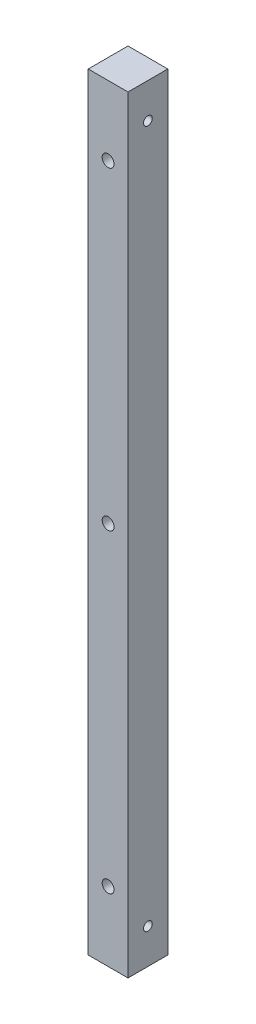
ISO-10303-21;
HEADER;
FILE_DESCRIPTION(('STEP AP214'),'2;1');
FILE_NAME('part.step','',(''),(''),'','','');
FILE_SCHEMA(('AUTOMOTIVE_DESIGN { 1 0 10303 214 1 1 1 1 }'));
ENDSEC;
DATA;
#1=APPLICATION_CONTEXT('core data for automotive mechanical design processes');
#2=APPLICATION_PROTOCOL_DEFINITION('international standard','automotive_design',2000,#1);
#3=PRODUCT_CONTEXT('',#1,'mechanical');
#4=PRODUCT('Part','Part','',(#3));
#5=PRODUCT_RELATED_PRODUCT_CATEGORY('part','',(#4));
#6=PRODUCT_DEFINITION_FORMATION('','',#4);
#7=PRODUCT_DEFINITION_CONTEXT('part definition',#1,'design');
#8=PRODUCT_DEFINITION('design','',#6,#7);
#9=PRODUCT_DEFINITION_SHAPE('','',#8);
#10=(LENGTH_UNIT() NAMED_UNIT(*) SI_UNIT(.MILLI.,.METRE.));
#11=(NAMED_UNIT(*) PLANE_ANGLE_UNIT() SI_UNIT($,.RADIAN.));
#12=(NAMED_UNIT(*) SI_UNIT($,.STERADIAN.) SOLID_ANGLE_UNIT());
#13=UNCERTAINTY_MEASURE_WITH_UNIT(LENGTH_MEASURE(1.E-05),#10,'distance_accuracy_value','');
#14=(GEOMETRIC_REPRESENTATION_CONTEXT(3) GLOBAL_UNCERTAINTY_ASSIGNED_CONTEXT((#13)) GLOBAL_UNIT_ASSIGNED_CONTEXT((#10,
#11,#12)) REPRESENTATION_CONTEXT('',''));
#15=CARTESIAN_POINT('',(0.,0.,0.));
#16=DIRECTION('',(0.,0.,1.));
#17=DIRECTION('',(1.,0.,0.));
#18=AXIS2_PLACEMENT_3D('',#15,#16,#17);
#19=CARTESIAN_POINT('',(5.7,219.772,-5.7));
#20=DIRECTION('',(-1.,0.,0.));
#21=DIRECTION('',(0.,0.,1.));
#22=AXIS2_PLACEMENT_3D('',#19,#20,#21);
#23=PLANE('',#22);
#24=CARTESIAN_POINT('',(5.7,209.772,0.));
#25=DIRECTION('',(1.,0.,0.));
#26=DIRECTION('',(0.,0.,-1.));
#27=AXIS2_PLACEMENT_3D('',#24,#25,#26);
#28=CIRCLE('',#27,1.25);
#29=CARTESIAN_POINT('',(5.7,209.772,-1.25));
#30=VERTEX_POINT('',#29);
#31=EDGE_CURVE('E133',#30,#30,#28,.T.);
#32=ORIENTED_EDGE('',*,*,#31,.F.);
#33=EDGE_LOOP('',(#32));
#34=FACE_BOUND('',#33,.T.);
#35=CARTESIAN_POINT('',(5.7,9.99999999999999,0.));
#36=DIRECTION('',(1.,0.,0.));
#37=DIRECTION('',(0.,0.,-1.));
#38=AXIS2_PLACEMENT_3D('',#35,#36,#37);
#39=CIRCLE('',#38,1.24999999999999);
#40=CARTESIAN_POINT('',(5.7,9.99999999999999,-1.24999999999999));
#41=VERTEX_POINT('',#40);
#42=EDGE_CURVE('E127',#41,#41,#39,.T.);
#43=ORIENTED_EDGE('',*,*,#42,.F.);
#44=EDGE_LOOP('',(#43));
#45=FACE_BOUND('',#44,.T.);
#46=DIRECTION('',(0.,0.,-1.));
#47=VECTOR('',#46,1.);
#48=CARTESIAN_POINT('',(5.7,0.,-5.7));
#49=LINE('',#48,#47);
#50=CARTESIAN_POINT('',(5.7,0.,5.7));
#51=VERTEX_POINT('',#50);
#52=CARTESIAN_POINT('',(5.7,0.,-5.7));
#53=VERTEX_POINT('',#52);
#54=EDGE_CURVE('E93',#51,#53,#49,.T.);
#55=ORIENTED_EDGE('',*,*,#54,.T.);
#56=DIRECTION('',(0.,-1.,0.));
#57=VECTOR('',#56,1.);
#58=CARTESIAN_POINT('',(5.7,219.772,-5.7));
#59=LINE('',#58,#57);
#60=CARTESIAN_POINT('',(5.7,219.772,-5.7));
#61=VERTEX_POINT('',#60);
#62=EDGE_CURVE('E11',#61,#53,#59,.T.);
#63=ORIENTED_EDGE('',*,*,#62,.F.);
#64=DIRECTION('',(0.,0.,-1.));
#65=VECTOR('',#64,1.);
#66=CARTESIAN_POINT('',(5.7,219.772,-5.7));
#67=LINE('',#66,#65);
#68=CARTESIAN_POINT('',(5.7,219.772,5.7));
#69=VERTEX_POINT('',#68);
#70=EDGE_CURVE('E81',#69,#61,#67,.T.);
#71=ORIENTED_EDGE('',*,*,#70,.F.);
#72=DIRECTION('',(0.,-1.,0.));
#73=VECTOR('',#72,1.);
#74=CARTESIAN_POINT('',(5.7,219.772,5.7));
#75=LINE('',#74,#73);
#76=EDGE_CURVE('E89',#69,#51,#75,.T.);
#77=ORIENTED_EDGE('',*,*,#76,.T.);
#78=EDGE_LOOP('',(#55,#63,#71,#77));
#79=FACE_BOUND('',#78,.T.);
#80=ADVANCED_FACE('F30',(#34,#45,#79),#23,.F.);
#81=CARTESIAN_POINT('',(-5.7,219.772,-5.7));
#82=DIRECTION('',(0.,0.,1.));
#83=DIRECTION('',(1.,0.,0.));
#84=AXIS2_PLACEMENT_3D('',#81,#82,#83);
#85=PLANE('',#84);
#86=CARTESIAN_POINT('',(0.,199.885,-5.7));
#87=DIRECTION('',(0.,0.,1.));
#88=DIRECTION('',(1.,0.,0.));
#89=AXIS2_PLACEMENT_3D('',#86,#87,#88);
#90=CIRCLE('',#89,1.7);
#91=CARTESIAN_POINT('',(1.7,199.885,-5.7));
#92=VERTEX_POINT('',#91);
#93=EDGE_CURVE('E118',#92,#92,#90,.T.);
#94=ORIENTED_EDGE('',*,*,#93,.T.);
#95=EDGE_LOOP('',(#94));
#96=FACE_BOUND('',#95,.T.);
#97=CARTESIAN_POINT('',(0.,109.885,-5.7));
#98=DIRECTION('',(0.,0.,1.));
#99=DIRECTION('',(1.,0.,0.));
#100=AXIS2_PLACEMENT_3D('',#97,#98,#99);
#101=CIRCLE('',#100,1.7);
#102=CARTESIAN_POINT('',(1.7,109.885,-5.7));
#103=VERTEX_POINT('',#102);
#104=EDGE_CURVE('E112',#103,#103,#101,.T.);
#105=ORIENTED_EDGE('',*,*,#104,.T.);
#106=EDGE_LOOP('',(#105));
#107=FACE_BOUND('',#106,.T.);
#108=CARTESIAN_POINT('',(0.,19.885,-5.7));
#109=DIRECTION('',(0.,0.,1.));
#110=DIRECTION('',(1.,0.,0.));
#111=AXIS2_PLACEMENT_3D('',#108,#109,#110);
#112=CIRCLE('',#111,1.7);
#113=CARTESIAN_POINT('',(1.7,19.885,-5.7));
#114=VERTEX_POINT('',#113);
#115=EDGE_CURVE('E96',#114,#114,#112,.T.);
#116=ORIENTED_EDGE('',*,*,#115,.T.);
#117=EDGE_LOOP('',(#116));
#118=FACE_BOUND('',#117,.T.);
#119=DIRECTION('',(-1.,0.,0.));
#120=VECTOR('',#119,1.);
#121=CARTESIAN_POINT('',(-5.7,0.,-5.7));
#122=LINE('',#121,#120);
#123=CARTESIAN_POINT('',(-5.7,0.,-5.7));
#124=VERTEX_POINT('',#123);
#125=EDGE_CURVE('E85',#53,#124,#122,.T.);
#126=ORIENTED_EDGE('',*,*,#125,.T.);
#127=DIRECTION('',(0.,-1.,0.));
#128=VECTOR('',#127,1.);
#129=CARTESIAN_POINT('',(-5.7,219.772,-5.7));
#130=LINE('',#129,#128);
#131=CARTESIAN_POINT('',(-5.7,219.772,-5.7));
#132=VERTEX_POINT('',#131);
#133=EDGE_CURVE('E38',#132,#124,#130,.T.);
#134=ORIENTED_EDGE('',*,*,#133,.F.);
#135=DIRECTION('',(-1.,0.,0.));
#136=VECTOR('',#135,1.);
#137=CARTESIAN_POINT('',(-5.7,219.772,-5.7));
#138=LINE('',#137,#136);
#139=EDGE_CURVE('E76',#61,#132,#138,.T.);
#140=ORIENTED_EDGE('',*,*,#139,.F.);
#141=ORIENTED_EDGE('',*,*,#62,.T.);
#142=EDGE_LOOP('',(#126,#134,#140,#141));
#143=FACE_BOUND('',#142,.T.);
#144=ADVANCED_FACE('F84',(#96,#107,#118,#143),#85,.F.);
#145=CARTESIAN_POINT('',(-5.7,219.772,-5.7));
#146=DIRECTION('',(1.,0.,0.));
#147=DIRECTION('',(0.,0.,-1.));
#148=AXIS2_PLACEMENT_3D('',#145,#146,#147);
#149=PLANE('',#148);
#150=CARTESIAN_POINT('',(-5.7,209.772,0.));
#151=DIRECTION('',(1.,0.,0.));
#152=DIRECTION('',(0.,0.,-1.));
#153=AXIS2_PLACEMENT_3D('',#150,#151,#152);
#154=CIRCLE('',#153,1.25);
#155=CARTESIAN_POINT('',(-5.7,209.772,-1.25));
#156=VERTEX_POINT('',#155);
#157=EDGE_CURVE('E130',#156,#156,#154,.T.);
#158=ORIENTED_EDGE('',*,*,#157,.T.);
#159=EDGE_LOOP('',(#158));
#160=FACE_BOUND('',#159,.T.);
#161=CARTESIAN_POINT('',(-5.7,9.99999999999999,0.));
#162=DIRECTION('',(1.,0.,0.));
#163=DIRECTION('',(0.,0.,-1.));
#164=AXIS2_PLACEMENT_3D('',#161,#162,#163);
#165=CIRCLE('',#164,1.25);
#166=CARTESIAN_POINT('',(-5.7,9.99999999999999,-1.25));
#167=VERTEX_POINT('',#166);
#168=EDGE_CURVE('E124',#167,#167,#165,.T.);
#169=ORIENTED_EDGE('',*,*,#168,.T.);
#170=EDGE_LOOP('',(#169));
#171=FACE_BOUND('',#170,.T.);
#172=DIRECTION('',(0.,0.,1.));
#173=VECTOR('',#172,1.);
#174=CARTESIAN_POINT('',(-5.7,0.,-5.7));
#175=LINE('',#174,#173);
#176=CARTESIAN_POINT('',(-5.7,0.,5.7));
#177=VERTEX_POINT('',#176);
#178=EDGE_CURVE('E63',#124,#177,#175,.T.);
#179=ORIENTED_EDGE('',*,*,#178,.T.);
#180=DIRECTION('',(0.,-1.,0.));
#181=VECTOR('',#180,1.);
#182=CARTESIAN_POINT('',(-5.7,219.772,5.7));
#183=LINE('',#182,#181);
#184=CARTESIAN_POINT('',(-5.7,219.772,5.7));
#185=VERTEX_POINT('',#184);
#186=EDGE_CURVE('E86',#185,#177,#183,.T.);
#187=ORIENTED_EDGE('',*,*,#186,.F.);
#188=DIRECTION('',(0.,0.,1.));
#189=VECTOR('',#188,1.);
#190=CARTESIAN_POINT('',(-5.7,219.772,-5.7));
#191=LINE('',#190,#189);
#192=EDGE_CURVE('E79',#132,#185,#191,.T.);
#193=ORIENTED_EDGE('',*,*,#192,.F.);
#194=ORIENTED_EDGE('',*,*,#133,.T.);
#195=EDGE_LOOP('',(#179,#187,#193,#194));
#196=FACE_BOUND('',#195,.T.);
#197=ADVANCED_FACE('F87',(#160,#171,#196),#149,.F.);
#198=CARTESIAN_POINT('',(-5.7,219.772,5.7));
#199=DIRECTION('',(0.,0.,-1.));
#200=DIRECTION('',(-1.,0.,0.));
#201=AXIS2_PLACEMENT_3D('',#198,#199,#200);
#202=PLANE('',#201);
#203=CARTESIAN_POINT('',(0.,199.885,5.7));
#204=DIRECTION('',(0.,0.,1.));
#205=DIRECTION('',(1.,0.,0.));
#206=AXIS2_PLACEMENT_3D('',#203,#204,#205);
#207=CIRCLE('',#206,1.7);
#208=CARTESIAN_POINT('',(1.7,199.885,5.7));
#209=VERTEX_POINT('',#208);
#210=EDGE_CURVE('E121',#209,#209,#207,.T.);
#211=ORIENTED_EDGE('',*,*,#210,.F.);
#212=EDGE_LOOP('',(#211));
#213=FACE_BOUND('',#212,.T.);
#214=CARTESIAN_POINT('',(0.,109.885,5.7));
#215=DIRECTION('',(0.,0.,1.));
#216=DIRECTION('',(1.,0.,0.));
#217=AXIS2_PLACEMENT_3D('',#214,#215,#216);
#218=CIRCLE('',#217,1.7);
#219=CARTESIAN_POINT('',(1.7,109.885,5.7));
#220=VERTEX_POINT('',#219);
#221=EDGE_CURVE('E115',#220,#220,#218,.T.);
#222=ORIENTED_EDGE('',*,*,#221,.F.);
#223=EDGE_LOOP('',(#222));
#224=FACE_BOUND('',#223,.T.);
#225=CARTESIAN_POINT('',(0.,19.885,5.7));
#226=DIRECTION('',(0.,0.,1.));
#227=DIRECTION('',(1.,0.,0.));
#228=AXIS2_PLACEMENT_3D('',#225,#226,#227);
#229=CIRCLE('',#228,1.7);
#230=CARTESIAN_POINT('',(1.7,19.885,5.7));
#231=VERTEX_POINT('',#230);
#232=EDGE_CURVE('E109',#231,#231,#229,.T.);
#233=ORIENTED_EDGE('',*,*,#232,.F.);
#234=EDGE_LOOP('',(#233));
#235=FACE_BOUND('',#234,.T.);
#236=DIRECTION('',(1.,0.,0.));
#237=VECTOR('',#236,1.);
#238=CARTESIAN_POINT('',(-5.7,0.,5.7));
#239=LINE('',#238,#237);
#240=EDGE_CURVE('E69',#177,#51,#239,.T.);
#241=ORIENTED_EDGE('',*,*,#240,.T.);
#242=ORIENTED_EDGE('',*,*,#76,.F.);
#243=DIRECTION('',(1.,0.,0.));
#244=VECTOR('',#243,1.);
#245=CARTESIAN_POINT('',(-5.7,219.772,5.7));
#246=LINE('',#245,#244);
#247=EDGE_CURVE('E46',#185,#69,#246,.T.);
#248=ORIENTED_EDGE('',*,*,#247,.F.);
#249=ORIENTED_EDGE('',*,*,#186,.T.);
#250=EDGE_LOOP('',(#241,#242,#248,#249));
#251=FACE_BOUND('',#250,.T.);
#252=ADVANCED_FACE('F101',(#213,#224,#235,#251),#202,.F.);
#253=CARTESIAN_POINT('',(5.7,219.772,5.7));
#254=DIRECTION('',(0.,1.,0.));
#255=DIRECTION('',(0.,0.,1.));
#256=AXIS2_PLACEMENT_3D('',#253,#254,#255);
#257=PLANE('',#256);
#258=ORIENTED_EDGE('',*,*,#70,.T.);
#259=ORIENTED_EDGE('',*,*,#139,.T.);
#260=ORIENTED_EDGE('',*,*,#192,.T.);
#261=ORIENTED_EDGE('',*,*,#247,.T.);
#262=EDGE_LOOP('',(#258,#259,#260,#261));
#263=FACE_BOUND('',#262,.T.);
#264=ADVANCED_FACE('F77',(#263),#257,.T.);
#265=CARTESIAN_POINT('',(5.7,0.,5.7));
#266=DIRECTION('',(0.,1.,0.));
#267=DIRECTION('',(0.,0.,1.));
#268=AXIS2_PLACEMENT_3D('',#265,#266,#267);
#269=PLANE('',#268);
#270=ORIENTED_EDGE('',*,*,#54,.F.);
#271=ORIENTED_EDGE('',*,*,#240,.F.);
#272=ORIENTED_EDGE('',*,*,#178,.F.);
#273=ORIENTED_EDGE('',*,*,#125,.F.);
#274=EDGE_LOOP('',(#270,#271,#272,#273));
#275=FACE_BOUND('',#274,.T.);
#276=ADVANCED_FACE('F104',(#275),#269,.F.);
#277=CARTESIAN_POINT('',(0.,19.885,5.7));
#278=DIRECTION('',(0.,0.,1.));
#279=DIRECTION('',(1.,0.,0.));
#280=AXIS2_PLACEMENT_3D('',#277,#278,#279);
#281=CYLINDRICAL_SURFACE('',#280,1.7);
#282=ORIENTED_EDGE('',*,*,#115,.F.);
#283=EDGE_LOOP('',(#282));
#284=FACE_BOUND('',#283,.T.);
#285=ORIENTED_EDGE('',*,*,#232,.T.);
#286=EDGE_LOOP('',(#285));
#287=FACE_BOUND('',#286,.T.);
#288=ADVANCED_FACE('F161',(#284,#287),#281,.F.);
#289=CARTESIAN_POINT('',(0.,109.885,5.7));
#290=DIRECTION('',(0.,0.,1.));
#291=DIRECTION('',(1.,0.,0.));
#292=AXIS2_PLACEMENT_3D('',#289,#290,#291);
#293=CYLINDRICAL_SURFACE('',#292,1.7);
#294=ORIENTED_EDGE('',*,*,#104,.F.);
#295=EDGE_LOOP('',(#294));
#296=FACE_BOUND('',#295,.T.);
#297=ORIENTED_EDGE('',*,*,#221,.T.);
#298=EDGE_LOOP('',(#297));
#299=FACE_BOUND('',#298,.T.);
#300=ADVANCED_FACE('F154',(#296,#299),#293,.F.);
#301=CARTESIAN_POINT('',(0.,199.885,5.7));
#302=DIRECTION('',(0.,0.,1.));
#303=DIRECTION('',(1.,0.,0.));
#304=AXIS2_PLACEMENT_3D('',#301,#302,#303);
#305=CYLINDRICAL_SURFACE('',#304,1.7);
#306=ORIENTED_EDGE('',*,*,#93,.F.);
#307=EDGE_LOOP('',(#306));
#308=FACE_BOUND('',#307,.T.);
#309=ORIENTED_EDGE('',*,*,#210,.T.);
#310=EDGE_LOOP('',(#309));
#311=FACE_BOUND('',#310,.T.);
#312=ADVANCED_FACE('F145',(#308,#311),#305,.F.);
#313=CARTESIAN_POINT('',(5.7,9.99999999999999,0.));
#314=DIRECTION('',(1.,0.,0.));
#315=DIRECTION('',(0.,0.,-1.));
#316=AXIS2_PLACEMENT_3D('',#313,#314,#315);
#317=CYLINDRICAL_SURFACE('',#316,1.24999999999999);
#318=ORIENTED_EDGE('',*,*,#168,.F.);
#319=EDGE_LOOP('',(#318));
#320=FACE_BOUND('',#319,.T.);
#321=ORIENTED_EDGE('',*,*,#42,.T.);
#322=EDGE_LOOP('',(#321));
#323=FACE_BOUND('',#322,.T.);
#324=ADVANCED_FACE('F143',(#320,#323),#317,.F.);
#325=CARTESIAN_POINT('',(5.7,209.772,0.));
#326=DIRECTION('',(1.,0.,0.));
#327=DIRECTION('',(0.,0.,-1.));
#328=AXIS2_PLACEMENT_3D('',#325,#326,#327);
#329=CYLINDRICAL_SURFACE('',#328,1.25);
#330=ORIENTED_EDGE('',*,*,#157,.F.);
#331=EDGE_LOOP('',(#330));
#332=FACE_BOUND('',#331,.T.);
#333=ORIENTED_EDGE('',*,*,#31,.T.);
#334=EDGE_LOOP('',(#333));
#335=FACE_BOUND('',#334,.T.);
#336=ADVANCED_FACE('F137',(#332,#335),#329,.F.);
#337=CLOSED_SHELL('',(#80,#144,#197,#252,#264,#276,#288,#300,#312,#324,#336));
#338=MANIFOLD_SOLID_BREP('B2',#337);
#339=ADVANCED_BREP_SHAPE_REPRESENTATION('',(#18,#338),#14);
#340=SHAPE_DEFINITION_REPRESENTATION(#9,#339);
ENDSEC;
END-ISO-10303-21;
